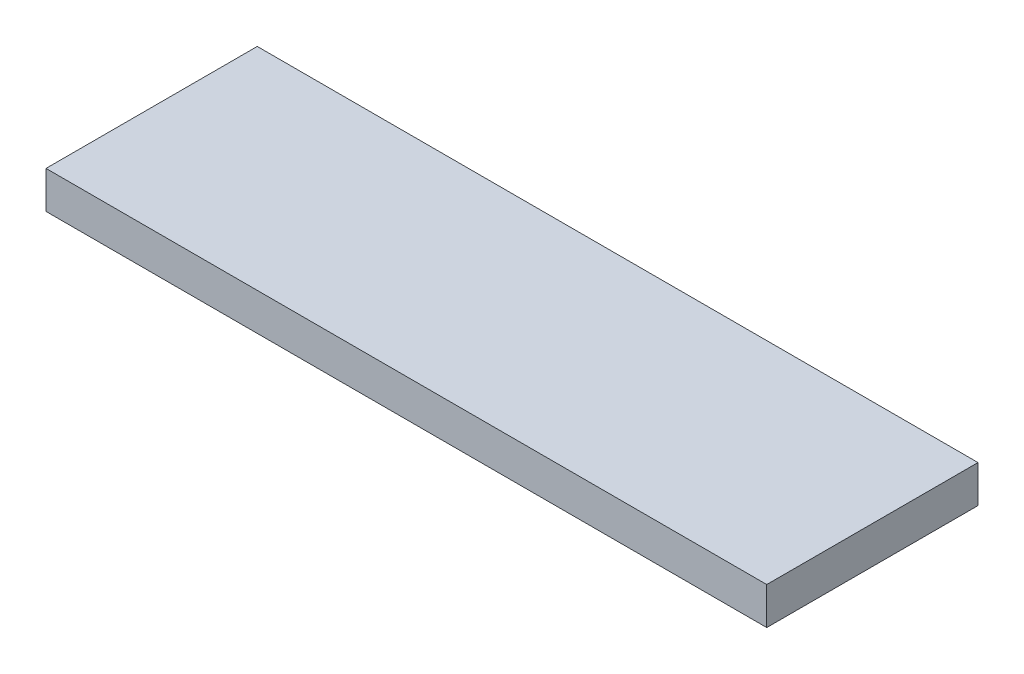
ISO-10303-21;
HEADER;
FILE_DESCRIPTION(('STEP AP214'),'2;1');
FILE_NAME('part.step','',(''),(''),'','','');
FILE_SCHEMA(('AUTOMOTIVE_DESIGN { 1 0 10303 214 1 1 1 1 }'));
ENDSEC;
DATA;
#1=APPLICATION_CONTEXT('core data for automotive mechanical design processes');
#2=APPLICATION_PROTOCOL_DEFINITION('international standard','automotive_design',2000,#1);
#3=PRODUCT_CONTEXT('',#1,'mechanical');
#4=PRODUCT('Part','Part','',(#3));
#5=PRODUCT_RELATED_PRODUCT_CATEGORY('part','',(#4));
#6=PRODUCT_DEFINITION_FORMATION('','',#4);
#7=PRODUCT_DEFINITION_CONTEXT('part definition',#1,'design');
#8=PRODUCT_DEFINITION('design','',#6,#7);
#9=PRODUCT_DEFINITION_SHAPE('','',#8);
#10=(LENGTH_UNIT() NAMED_UNIT(*) SI_UNIT(.MILLI.,.METRE.));
#11=(NAMED_UNIT(*) PLANE_ANGLE_UNIT() SI_UNIT($,.RADIAN.));
#12=(NAMED_UNIT(*) SI_UNIT($,.STERADIAN.) SOLID_ANGLE_UNIT());
#13=UNCERTAINTY_MEASURE_WITH_UNIT(LENGTH_MEASURE(1.E-05),#10,'distance_accuracy_value','');
#14=(GEOMETRIC_REPRESENTATION_CONTEXT(3) GLOBAL_UNCERTAINTY_ASSIGNED_CONTEXT((#13)) GLOBAL_UNIT_ASSIGNED_CONTEXT((#10,
#11,#12)) REPRESENTATION_CONTEXT('',''));
#15=CARTESIAN_POINT('',(0.,0.,0.));
#16=DIRECTION('',(0.,0.,1.));
#17=DIRECTION('',(1.,0.,0.));
#18=AXIS2_PLACEMENT_3D('',#15,#16,#17);
#19=CARTESIAN_POINT('',(5800.,0.,-1700.));
#20=DIRECTION('',(0.,1.,0.));
#21=DIRECTION('',(0.,0.,1.));
#22=AXIS2_PLACEMENT_3D('',#19,#20,#21);
#23=PLANE('',#22);
#24=DIRECTION('',(0.,0.,-1.));
#25=VECTOR('',#24,1.);
#26=CARTESIAN_POINT('',(4450.,0.,-250.));
#27=LINE('',#26,#25);
#28=CARTESIAN_POINT('',(4450.,0.,-250.));
#29=VERTEX_POINT('',#28);
#30=CARTESIAN_POINT('',(4450.,0.,-1450.));
#31=VERTEX_POINT('',#30);
#32=EDGE_CURVE('E208',#29,#31,#27,.T.);
#33=ORIENTED_EDGE('',*,*,#32,.F.);
#34=DIRECTION('',(-1.,0.,0.));
#35=VECTOR('',#34,1.);
#36=CARTESIAN_POINT('',(4450.,0.,-250.));
#37=LINE('',#36,#35);
#38=CARTESIAN_POINT('',(5450.,0.,-250.));
#39=VERTEX_POINT('',#38);
#40=EDGE_CURVE('E182',#39,#29,#37,.T.);
#41=ORIENTED_EDGE('',*,*,#40,.F.);
#42=DIRECTION('',(0.,0.,1.));
#43=VECTOR('',#42,1.);
#44=CARTESIAN_POINT('',(5450.,0.,-250.));
#45=LINE('',#44,#43);
#46=CARTESIAN_POINT('',(5450.,0.,-1450.));
#47=VERTEX_POINT('',#46);
#48=EDGE_CURVE('E199',#47,#39,#45,.T.);
#49=ORIENTED_EDGE('',*,*,#48,.F.);
#50=DIRECTION('',(1.,0.,0.));
#51=VECTOR('',#50,1.);
#52=CARTESIAN_POINT('',(4450.,0.,-1450.));
#53=LINE('',#52,#51);
#54=EDGE_CURVE('E202',#31,#47,#53,.T.);
#55=ORIENTED_EDGE('',*,*,#54,.F.);
#56=EDGE_LOOP('',(#33,#41,#49,#55));
#57=FACE_BOUND('',#56,.T.);
#58=DIRECTION('',(0.,0.,-1.));
#59=VECTOR('',#58,1.);
#60=CARTESIAN_POINT('',(3100.,0.,-250.));
#61=LINE('',#60,#59);
#62=CARTESIAN_POINT('',(3100.,0.,-250.));
#63=VERTEX_POINT('',#62);
#64=CARTESIAN_POINT('',(3100.,0.,-1450.));
#65=VERTEX_POINT('',#64);
#66=EDGE_CURVE('E233',#63,#65,#61,.T.);
#67=ORIENTED_EDGE('',*,*,#66,.F.);
#68=DIRECTION('',(-1.,0.,0.));
#69=VECTOR('',#68,1.);
#70=CARTESIAN_POINT('',(3100.,0.,-250.));
#71=LINE('',#70,#69);
#72=CARTESIAN_POINT('',(4100.,0.,-250.));
#73=VERTEX_POINT('',#72);
#74=EDGE_CURVE('E214',#73,#63,#71,.T.);
#75=ORIENTED_EDGE('',*,*,#74,.F.);
#76=DIRECTION('',(0.,0.,1.));
#77=VECTOR('',#76,1.);
#78=CARTESIAN_POINT('',(4100.,0.,-250.));
#79=LINE('',#78,#77);
#80=CARTESIAN_POINT('',(4100.,0.,-1450.));
#81=VERTEX_POINT('',#80);
#82=EDGE_CURVE('E222',#81,#73,#79,.T.);
#83=ORIENTED_EDGE('',*,*,#82,.F.);
#84=DIRECTION('',(1.,0.,0.));
#85=VECTOR('',#84,1.);
#86=CARTESIAN_POINT('',(3100.,0.,-1450.));
#87=LINE('',#86,#85);
#88=EDGE_CURVE('E236',#65,#81,#87,.T.);
#89=ORIENTED_EDGE('',*,*,#88,.F.);
#90=EDGE_LOOP('',(#67,#75,#83,#89));
#91=FACE_BOUND('',#90,.T.);
#92=DIRECTION('',(0.,0.,-1.));
#93=VECTOR('',#92,1.);
#94=CARTESIAN_POINT('',(1750.,0.,-250.));
#95=LINE('',#94,#93);
#96=CARTESIAN_POINT('',(1750.,0.,-250.));
#97=VERTEX_POINT('',#96);
#98=CARTESIAN_POINT('',(1750.,0.,-1450.));
#99=VERTEX_POINT('',#98);
#100=EDGE_CURVE('E265',#97,#99,#95,.T.);
#101=ORIENTED_EDGE('',*,*,#100,.F.);
#102=DIRECTION('',(-1.,0.,0.));
#103=VECTOR('',#102,1.);
#104=CARTESIAN_POINT('',(1750.,0.,-250.));
#105=LINE('',#104,#103);
#106=CARTESIAN_POINT('',(2750.,0.,-250.));
#107=VERTEX_POINT('',#106);
#108=EDGE_CURVE('E243',#107,#97,#105,.T.);
#109=ORIENTED_EDGE('',*,*,#108,.F.);
#110=DIRECTION('',(0.,0.,1.));
#111=VECTOR('',#110,1.);
#112=CARTESIAN_POINT('',(2750.,0.,-250.));
#113=LINE('',#112,#111);
#114=CARTESIAN_POINT('',(2750.,0.,-1450.));
#115=VERTEX_POINT('',#114);
#116=EDGE_CURVE('E254',#115,#107,#113,.T.);
#117=ORIENTED_EDGE('',*,*,#116,.F.);
#118=DIRECTION('',(1.,0.,0.));
#119=VECTOR('',#118,1.);
#120=CARTESIAN_POINT('',(1750.,0.,-1450.));
#121=LINE('',#120,#119);
#122=EDGE_CURVE('E268',#99,#115,#121,.T.);
#123=ORIENTED_EDGE('',*,*,#122,.F.);
#124=EDGE_LOOP('',(#101,#109,#117,#123));
#125=FACE_BOUND('',#124,.T.);
#126=DIRECTION('',(1.,0.,0.));
#127=VECTOR('',#126,1.);
#128=CARTESIAN_POINT('',(400.,0.,-1450.));
#129=LINE('',#128,#127);
#130=CARTESIAN_POINT('',(399.999999999999,0.,-1450.));
#131=VERTEX_POINT('',#130);
#132=CARTESIAN_POINT('',(1400.,0.,-1450.));
#133=VERTEX_POINT('',#132);
#134=EDGE_CURVE('E294',#131,#133,#129,.T.);
#135=ORIENTED_EDGE('',*,*,#134,.F.);
#136=DIRECTION('',(0.,0.,-1.));
#137=VECTOR('',#136,1.);
#138=CARTESIAN_POINT('',(400.,0.,-250.));
#139=LINE('',#138,#137);
#140=CARTESIAN_POINT('',(400.,0.,-250.));
#141=VERTEX_POINT('',#140);
#142=EDGE_CURVE('E275',#141,#131,#139,.T.);
#143=ORIENTED_EDGE('',*,*,#142,.F.);
#144=DIRECTION('',(-1.,0.,0.));
#145=VECTOR('',#144,1.);
#146=CARTESIAN_POINT('',(400.,0.,-250.));
#147=LINE('',#146,#145);
#148=CARTESIAN_POINT('',(1400.,0.,-250.));
#149=VERTEX_POINT('',#148);
#150=EDGE_CURVE('E285',#149,#141,#147,.T.);
#151=ORIENTED_EDGE('',*,*,#150,.F.);
#152=DIRECTION('',(0.,0.,1.));
#153=VECTOR('',#152,1.);
#154=CARTESIAN_POINT('',(1400.,0.,-250.));
#155=LINE('',#154,#153);
#156=EDGE_CURVE('E297',#133,#149,#155,.T.);
#157=ORIENTED_EDGE('',*,*,#156,.F.);
#158=EDGE_LOOP('',(#135,#143,#151,#157));
#159=FACE_BOUND('',#158,.T.);
#160=DIRECTION('',(0.,0.,-1.));
#161=VECTOR('',#160,1.);
#162=CARTESIAN_POINT('',(0.,0.,-1700.));
#163=LINE('',#162,#161);
#164=CARTESIAN_POINT('',(0.,0.,0.));
#165=VERTEX_POINT('',#164);
#166=CARTESIAN_POINT('',(0.,0.,-1700.));
#167=VERTEX_POINT('',#166);
#168=EDGE_CURVE('E304',#165,#167,#163,.T.);
#169=ORIENTED_EDGE('',*,*,#168,.T.);
#170=DIRECTION('',(-1.,0.,0.));
#171=VECTOR('',#170,1.);
#172=CARTESIAN_POINT('',(5800.,0.,-1700.));
#173=LINE('',#172,#171);
#174=CARTESIAN_POINT('',(5800.,0.,-1700.));
#175=VERTEX_POINT('',#174);
#176=EDGE_CURVE('E336',#175,#167,#173,.T.);
#177=ORIENTED_EDGE('',*,*,#176,.F.);
#178=DIRECTION('',(0.,0.,-1.));
#179=VECTOR('',#178,1.);
#180=CARTESIAN_POINT('',(5800.,0.,-1700.));
#181=LINE('',#180,#179);
#182=CARTESIAN_POINT('',(5800.,0.,0.));
#183=VERTEX_POINT('',#182);
#184=EDGE_CURVE('E310',#183,#175,#181,.T.);
#185=ORIENTED_EDGE('',*,*,#184,.F.);
#186=DIRECTION('',(-1.,0.,0.));
#187=VECTOR('',#186,1.);
#188=CARTESIAN_POINT('',(5800.,0.,0.));
#189=LINE('',#188,#187);
#190=EDGE_CURVE('E320',#183,#165,#189,.T.);
#191=ORIENTED_EDGE('',*,*,#190,.T.);
#192=EDGE_LOOP('',(#169,#177,#185,#191));
#193=FACE_BOUND('',#192,.T.);
#194=ADVANCED_FACE('F34',(#57,#91,#125,#159,#193),#23,.F.);
#195=CARTESIAN_POINT('',(5800.,300.,-1700.));
#196=DIRECTION('',(0.,0.,1.));
#197=DIRECTION('',(1.,0.,0.));
#198=AXIS2_PLACEMENT_3D('',#195,#196,#197);
#199=PLANE('',#198);
#200=DIRECTION('',(0.,1.,0.));
#201=VECTOR('',#200,1.);
#202=CARTESIAN_POINT('',(0.,300.,-1700.));
#203=LINE('',#202,#201);
#204=CARTESIAN_POINT('',(0.,300.,-1700.));
#205=VERTEX_POINT('',#204);
#206=EDGE_CURVE('E323',#167,#205,#203,.T.);
#207=ORIENTED_EDGE('',*,*,#206,.T.);
#208=DIRECTION('',(-1.,0.,0.));
#209=VECTOR('',#208,1.);
#210=CARTESIAN_POINT('',(5800.,300.,-1700.));
#211=LINE('',#210,#209);
#212=CARTESIAN_POINT('',(5800.,300.,-1700.));
#213=VERTEX_POINT('',#212);
#214=EDGE_CURVE('E333',#213,#205,#211,.T.);
#215=ORIENTED_EDGE('',*,*,#214,.F.);
#216=DIRECTION('',(0.,1.,0.));
#217=VECTOR('',#216,1.);
#218=CARTESIAN_POINT('',(5800.,300.,-1700.));
#219=LINE('',#218,#217);
#220=EDGE_CURVE('E313',#175,#213,#219,.T.);
#221=ORIENTED_EDGE('',*,*,#220,.F.);
#222=ORIENTED_EDGE('',*,*,#176,.T.);
#223=EDGE_LOOP('',(#207,#215,#221,#222));
#224=FACE_BOUND('',#223,.T.);
#225=ADVANCED_FACE('F363',(#224),#199,.F.);
#226=CARTESIAN_POINT('',(5800.,300.,0.));
#227=DIRECTION('',(0.,-1.,0.));
#228=DIRECTION('',(0.,0.,-1.));
#229=AXIS2_PLACEMENT_3D('',#226,#227,#228);
#230=PLANE('',#229);
#231=DIRECTION('',(0.,0.,1.));
#232=VECTOR('',#231,1.);
#233=CARTESIAN_POINT('',(0.,300.,0.));
#234=LINE('',#233,#232);
#235=CARTESIAN_POINT('',(0.,300.,0.));
#236=VERTEX_POINT('',#235);
#237=EDGE_CURVE('E325',#205,#236,#234,.T.);
#238=ORIENTED_EDGE('',*,*,#237,.T.);
#239=DIRECTION('',(-1.,0.,0.));
#240=VECTOR('',#239,1.);
#241=CARTESIAN_POINT('',(5800.,300.,0.));
#242=LINE('',#241,#240);
#243=CARTESIAN_POINT('',(5800.,300.,0.));
#244=VERTEX_POINT('',#243);
#245=EDGE_CURVE('E330',#244,#236,#242,.T.);
#246=ORIENTED_EDGE('',*,*,#245,.F.);
#247=DIRECTION('',(0.,0.,1.));
#248=VECTOR('',#247,1.);
#249=CARTESIAN_POINT('',(5800.,300.,0.));
#250=LINE('',#249,#248);
#251=EDGE_CURVE('E316',#213,#244,#250,.T.);
#252=ORIENTED_EDGE('',*,*,#251,.F.);
#253=ORIENTED_EDGE('',*,*,#214,.T.);
#254=EDGE_LOOP('',(#238,#246,#252,#253));
#255=FACE_BOUND('',#254,.T.);
#256=ADVANCED_FACE('F368',(#255),#230,.F.);
#257=CARTESIAN_POINT('',(5800.,0.,0.));
#258=DIRECTION('',(0.,0.,-1.));
#259=DIRECTION('',(-1.,0.,0.));
#260=AXIS2_PLACEMENT_3D('',#257,#258,#259);
#261=PLANE('',#260);
#262=DIRECTION('',(0.,-1.,0.));
#263=VECTOR('',#262,1.);
#264=CARTESIAN_POINT('',(0.,0.,0.));
#265=LINE('',#264,#263);
#266=EDGE_CURVE('E314',#236,#165,#265,.T.);
#267=ORIENTED_EDGE('',*,*,#266,.T.);
#268=ORIENTED_EDGE('',*,*,#190,.F.);
#269=DIRECTION('',(0.,-1.,0.));
#270=VECTOR('',#269,1.);
#271=CARTESIAN_POINT('',(5800.,0.,0.));
#272=LINE('',#271,#270);
#273=EDGE_CURVE('E318',#244,#183,#272,.T.);
#274=ORIENTED_EDGE('',*,*,#273,.F.);
#275=ORIENTED_EDGE('',*,*,#245,.T.);
#276=EDGE_LOOP('',(#267,#268,#274,#275));
#277=FACE_BOUND('',#276,.T.);
#278=ADVANCED_FACE('F375',(#277),#261,.F.);
#279=CARTESIAN_POINT('',(5800.,0.,0.));
#280=DIRECTION('',(-1.,0.,0.));
#281=DIRECTION('',(0.,0.,1.));
#282=AXIS2_PLACEMENT_3D('',#279,#280,#281);
#283=PLANE('',#282);
#284=ORIENTED_EDGE('',*,*,#184,.T.);
#285=ORIENTED_EDGE('',*,*,#220,.T.);
#286=ORIENTED_EDGE('',*,*,#251,.T.);
#287=ORIENTED_EDGE('',*,*,#273,.T.);
#288=EDGE_LOOP('',(#284,#285,#286,#287));
#289=FACE_BOUND('',#288,.T.);
#290=ADVANCED_FACE('F379',(#289),#283,.F.);
#291=CARTESIAN_POINT('',(0.,0.,0.));
#292=DIRECTION('',(-1.,0.,0.));
#293=DIRECTION('',(0.,0.,1.));
#294=AXIS2_PLACEMENT_3D('',#291,#292,#293);
#295=PLANE('',#294);
#296=ORIENTED_EDGE('',*,*,#168,.F.);
#297=ORIENTED_EDGE('',*,*,#266,.F.);
#298=ORIENTED_EDGE('',*,*,#237,.F.);
#299=ORIENTED_EDGE('',*,*,#206,.F.);
#300=EDGE_LOOP('',(#296,#297,#298,#299));
#301=FACE_BOUND('',#300,.T.);
#302=ADVANCED_FACE('F381',(#301),#295,.T.);
#303=CARTESIAN_POINT('',(400.,100.,-250.));
#304=DIRECTION('',(-1.,0.,0.));
#305=DIRECTION('',(0.,0.,1.));
#306=AXIS2_PLACEMENT_3D('',#303,#304,#305);
#307=PLANE('',#306);
#308=DIRECTION('',(0.,-1.,0.));
#309=VECTOR('',#308,1.);
#310=CARTESIAN_POINT('',(400.,100.,-1450.));
#311=LINE('',#310,#309);
#312=CARTESIAN_POINT('',(400.,60.,-1450.));
#313=VERTEX_POINT('',#312);
#314=EDGE_CURVE('E291',#313,#131,#311,.T.);
#315=ORIENTED_EDGE('',*,*,#314,.F.);
#316=DIRECTION('',(0.,0.,-1.));
#317=VECTOR('',#316,1.);
#318=CARTESIAN_POINT('',(400.,60.,-250.));
#319=LINE('',#318,#317);
#320=CARTESIAN_POINT('',(400.,60.,-250.));
#321=VERTEX_POINT('',#320);
#322=EDGE_CURVE('E42',#313,#321,#319,.F.);
#323=ORIENTED_EDGE('',*,*,#322,.T.);
#324=DIRECTION('',(0.,-1.,0.));
#325=VECTOR('',#324,1.);
#326=CARTESIAN_POINT('',(400.,100.,-250.));
#327=LINE('',#326,#325);
#328=EDGE_CURVE('E302',#321,#141,#327,.T.);
#329=ORIENTED_EDGE('',*,*,#328,.T.);
#330=ORIENTED_EDGE('',*,*,#142,.T.);
#331=EDGE_LOOP('',(#315,#323,#329,#330));
#332=FACE_BOUND('',#331,.T.);
#333=ADVANCED_FACE('F384',(#332),#307,.F.);
#334=CARTESIAN_POINT('',(400.,100.,-250.));
#335=DIRECTION('',(0.,0.,1.));
#336=DIRECTION('',(0.,-1.,0.));
#337=AXIS2_PLACEMENT_3D('',#334,#335,#336);
#338=PLANE('',#337);
#339=ORIENTED_EDGE('',*,*,#328,.F.);
#340=CARTESIAN_POINT('',(440.,60.,-250.));
#341=DIRECTION('',(0.,0.,1.));
#342=DIRECTION('',(0.,-1.,0.));
#343=AXIS2_PLACEMENT_3D('',#340,#341,#342);
#344=CIRCLE('',#343,40.);
#345=CARTESIAN_POINT('',(440.,100.,-250.));
#346=VERTEX_POINT('',#345);
#347=EDGE_CURVE('E11',#321,#346,#344,.F.);
#348=ORIENTED_EDGE('',*,*,#347,.T.);
#349=DIRECTION('',(-1.,0.,0.));
#350=VECTOR('',#349,1.);
#351=CARTESIAN_POINT('',(400.,100.,-250.));
#352=LINE('',#351,#350);
#353=CARTESIAN_POINT('',(1400.,100.,-250.));
#354=VERTEX_POINT('',#353);
#355=EDGE_CURVE('E288',#354,#346,#352,.T.);
#356=ORIENTED_EDGE('',*,*,#355,.F.);
#357=DIRECTION('',(0.,-1.,0.));
#358=VECTOR('',#357,1.);
#359=CARTESIAN_POINT('',(1400.,100.,-250.));
#360=LINE('',#359,#358);
#361=EDGE_CURVE('E305',#354,#149,#360,.T.);
#362=ORIENTED_EDGE('',*,*,#361,.T.);
#363=ORIENTED_EDGE('',*,*,#150,.T.);
#364=EDGE_LOOP('',(#339,#348,#356,#362,#363));
#365=FACE_BOUND('',#364,.T.);
#366=ADVANCED_FACE('F356',(#365),#338,.F.);
#367=CARTESIAN_POINT('',(1400.,100.,-250.));
#368=DIRECTION('',(1.,0.,0.));
#369=DIRECTION('',(0.,0.,-1.));
#370=AXIS2_PLACEMENT_3D('',#367,#368,#369);
#371=PLANE('',#370);
#372=ORIENTED_EDGE('',*,*,#156,.T.);
#373=ORIENTED_EDGE('',*,*,#361,.F.);
#374=DIRECTION('',(0.,0.,1.));
#375=VECTOR('',#374,1.);
#376=CARTESIAN_POINT('',(1400.,100.,-250.));
#377=LINE('',#376,#375);
#378=CARTESIAN_POINT('',(1400.,100.,-1450.));
#379=VERTEX_POINT('',#378);
#380=EDGE_CURVE('E284',#379,#354,#377,.T.);
#381=ORIENTED_EDGE('',*,*,#380,.F.);
#382=DIRECTION('',(0.,-1.,0.));
#383=VECTOR('',#382,1.);
#384=CARTESIAN_POINT('',(1400.,100.,-1450.));
#385=LINE('',#384,#383);
#386=EDGE_CURVE('E307',#379,#133,#385,.T.);
#387=ORIENTED_EDGE('',*,*,#386,.T.);
#388=EDGE_LOOP('',(#372,#373,#381,#387));
#389=FACE_BOUND('',#388,.T.);
#390=ADVANCED_FACE('F354',(#389),#371,.F.);
#391=CARTESIAN_POINT('',(400.,100.,-1450.));
#392=DIRECTION('',(0.,0.,-1.));
#393=DIRECTION('',(0.,1.,0.));
#394=AXIS2_PLACEMENT_3D('',#391,#392,#393);
#395=PLANE('',#394);
#396=DIRECTION('',(1.,0.,0.));
#397=VECTOR('',#396,1.);
#398=CARTESIAN_POINT('',(400.,100.,-1450.));
#399=LINE('',#398,#397);
#400=CARTESIAN_POINT('',(440.,100.,-1450.));
#401=VERTEX_POINT('',#400);
#402=EDGE_CURVE('E282',#401,#379,#399,.T.);
#403=ORIENTED_EDGE('',*,*,#402,.F.);
#404=CARTESIAN_POINT('',(440.,60.,-1450.));
#405=DIRECTION('',(0.,0.,-1.));
#406=DIRECTION('',(0.,1.,0.));
#407=AXIS2_PLACEMENT_3D('',#404,#405,#406);
#408=CIRCLE('',#407,40.);
#409=EDGE_CURVE('E56',#401,#313,#408,.F.);
#410=ORIENTED_EDGE('',*,*,#409,.T.);
#411=ORIENTED_EDGE('',*,*,#314,.T.);
#412=ORIENTED_EDGE('',*,*,#134,.T.);
#413=ORIENTED_EDGE('',*,*,#386,.F.);
#414=EDGE_LOOP('',(#403,#410,#411,#412,#413));
#415=FACE_BOUND('',#414,.T.);
#416=ADVANCED_FACE('F349',(#415),#395,.F.);
#417=CARTESIAN_POINT('',(0.,100.,0.));
#418=DIRECTION('',(0.,-1.,0.));
#419=DIRECTION('',(0.,0.,-1.));
#420=AXIS2_PLACEMENT_3D('',#417,#418,#419);
#421=PLANE('',#420);
#422=ORIENTED_EDGE('',*,*,#355,.T.);
#423=DIRECTION('',(0.,0.,-1.));
#424=VECTOR('',#423,1.);
#425=CARTESIAN_POINT('',(440.,100.,0.));
#426=LINE('',#425,#424);
#427=EDGE_CURVE('E339',#346,#401,#426,.T.);
#428=ORIENTED_EDGE('',*,*,#427,.T.);
#429=ORIENTED_EDGE('',*,*,#402,.T.);
#430=ORIENTED_EDGE('',*,*,#380,.T.);
#431=EDGE_LOOP('',(#422,#428,#429,#430));
#432=FACE_BOUND('',#431,.T.);
#433=ADVANCED_FACE('F344',(#432),#421,.T.);
#434=CARTESIAN_POINT('',(1750.,100.,-250.));
#435=DIRECTION('',(0.,0.,1.));
#436=DIRECTION('',(0.,-1.,0.));
#437=AXIS2_PLACEMENT_3D('',#434,#435,#436);
#438=PLANE('',#437);
#439=ORIENTED_EDGE('',*,*,#108,.T.);
#440=DIRECTION('',(0.,-1.,0.));
#441=VECTOR('',#440,1.);
#442=CARTESIAN_POINT('',(1750.,100.,-250.));
#443=LINE('',#442,#441);
#444=CARTESIAN_POINT('',(1750.,100.,-250.));
#445=VERTEX_POINT('',#444);
#446=EDGE_CURVE('E263',#445,#97,#443,.T.);
#447=ORIENTED_EDGE('',*,*,#446,.F.);
#448=DIRECTION('',(-1.,0.,0.));
#449=VECTOR('',#448,1.);
#450=CARTESIAN_POINT('',(1750.,100.,-250.));
#451=LINE('',#450,#449);
#452=CARTESIAN_POINT('',(2750.,100.,-250.));
#453=VERTEX_POINT('',#452);
#454=EDGE_CURVE('E250',#453,#445,#451,.T.);
#455=ORIENTED_EDGE('',*,*,#454,.F.);
#456=DIRECTION('',(0.,-1.,0.));
#457=VECTOR('',#456,1.);
#458=CARTESIAN_POINT('',(2750.,100.,-250.));
#459=LINE('',#458,#457);
#460=EDGE_CURVE('E273',#453,#107,#459,.T.);
#461=ORIENTED_EDGE('',*,*,#460,.T.);
#462=EDGE_LOOP('',(#439,#447,#455,#461));
#463=FACE_BOUND('',#462,.T.);
#464=ADVANCED_FACE('F399',(#463),#438,.F.);
#465=CARTESIAN_POINT('',(2750.,100.,-250.));
#466=DIRECTION('',(1.,0.,0.));
#467=DIRECTION('',(0.,0.,-1.));
#468=AXIS2_PLACEMENT_3D('',#465,#466,#467);
#469=PLANE('',#468);
#470=ORIENTED_EDGE('',*,*,#116,.T.);
#471=ORIENTED_EDGE('',*,*,#460,.F.);
#472=DIRECTION('',(0.,0.,1.));
#473=VECTOR('',#472,1.);
#474=CARTESIAN_POINT('',(2750.,100.,-250.));
#475=LINE('',#474,#473);
#476=CARTESIAN_POINT('',(2750.,100.,-1450.));
#477=VERTEX_POINT('',#476);
#478=EDGE_CURVE('E260',#477,#453,#475,.T.);
#479=ORIENTED_EDGE('',*,*,#478,.F.);
#480=DIRECTION('',(0.,-1.,0.));
#481=VECTOR('',#480,1.);
#482=CARTESIAN_POINT('',(2750.,100.,-1450.));
#483=LINE('',#482,#481);
#484=EDGE_CURVE('E276',#477,#115,#483,.T.);
#485=ORIENTED_EDGE('',*,*,#484,.T.);
#486=EDGE_LOOP('',(#470,#471,#479,#485));
#487=FACE_BOUND('',#486,.T.);
#488=ADVANCED_FACE('F402',(#487),#469,.F.);
#489=CARTESIAN_POINT('',(1750.,100.,-1450.));
#490=DIRECTION('',(0.,0.,-1.));
#491=DIRECTION('',(0.,1.,0.));
#492=AXIS2_PLACEMENT_3D('',#489,#490,#491);
#493=PLANE('',#492);
#494=ORIENTED_EDGE('',*,*,#122,.T.);
#495=ORIENTED_EDGE('',*,*,#484,.F.);
#496=DIRECTION('',(1.,0.,0.));
#497=VECTOR('',#496,1.);
#498=CARTESIAN_POINT('',(1750.,100.,-1450.));
#499=LINE('',#498,#497);
#500=CARTESIAN_POINT('',(1750.,100.,-1450.));
#501=VERTEX_POINT('',#500);
#502=EDGE_CURVE('E257',#501,#477,#499,.T.);
#503=ORIENTED_EDGE('',*,*,#502,.F.);
#504=DIRECTION('',(0.,-1.,0.));
#505=VECTOR('',#504,1.);
#506=CARTESIAN_POINT('',(1750.,100.,-1450.));
#507=LINE('',#506,#505);
#508=EDGE_CURVE('E278',#501,#99,#507,.T.);
#509=ORIENTED_EDGE('',*,*,#508,.T.);
#510=EDGE_LOOP('',(#494,#495,#503,#509));
#511=FACE_BOUND('',#510,.T.);
#512=ADVANCED_FACE('F408',(#511),#493,.F.);
#513=CARTESIAN_POINT('',(1750.,100.,-250.));
#514=DIRECTION('',(-1.,0.,0.));
#515=DIRECTION('',(0.,0.,1.));
#516=AXIS2_PLACEMENT_3D('',#513,#514,#515);
#517=PLANE('',#516);
#518=ORIENTED_EDGE('',*,*,#100,.T.);
#519=ORIENTED_EDGE('',*,*,#508,.F.);
#520=DIRECTION('',(0.,0.,-1.));
#521=VECTOR('',#520,1.);
#522=CARTESIAN_POINT('',(1750.,100.,-250.));
#523=LINE('',#522,#521);
#524=EDGE_CURVE('E253',#445,#501,#523,.T.);
#525=ORIENTED_EDGE('',*,*,#524,.F.);
#526=ORIENTED_EDGE('',*,*,#446,.T.);
#527=EDGE_LOOP('',(#518,#519,#525,#526));
#528=FACE_BOUND('',#527,.T.);
#529=ADVANCED_FACE('F404',(#528),#517,.F.);
#530=CARTESIAN_POINT('',(0.,100.,0.));
#531=DIRECTION('',(0.,1.,0.));
#532=DIRECTION('',(0.,0.,1.));
#533=AXIS2_PLACEMENT_3D('',#530,#531,#532);
#534=PLANE('',#533);
#535=ORIENTED_EDGE('',*,*,#454,.T.);
#536=ORIENTED_EDGE('',*,*,#524,.T.);
#537=ORIENTED_EDGE('',*,*,#502,.T.);
#538=ORIENTED_EDGE('',*,*,#478,.T.);
#539=EDGE_LOOP('',(#535,#536,#537,#538));
#540=FACE_BOUND('',#539,.T.);
#541=ADVANCED_FACE('F407',(#540),#534,.F.);
#542=CARTESIAN_POINT('',(3100.,100.,-250.));
#543=DIRECTION('',(0.,0.,1.));
#544=DIRECTION('',(0.,-1.,0.));
#545=AXIS2_PLACEMENT_3D('',#542,#543,#544);
#546=PLANE('',#545);
#547=ORIENTED_EDGE('',*,*,#74,.T.);
#548=DIRECTION('',(0.,-1.,0.));
#549=VECTOR('',#548,1.);
#550=CARTESIAN_POINT('',(3100.,100.,-250.));
#551=LINE('',#550,#549);
#552=CARTESIAN_POINT('',(3100.,100.,-250.));
#553=VERTEX_POINT('',#552);
#554=EDGE_CURVE('E231',#553,#63,#551,.T.);
#555=ORIENTED_EDGE('',*,*,#554,.F.);
#556=DIRECTION('',(-1.,0.,0.));
#557=VECTOR('',#556,1.);
#558=CARTESIAN_POINT('',(3100.,100.,-250.));
#559=LINE('',#558,#557);
#560=CARTESIAN_POINT('',(4100.,100.,-250.));
#561=VERTEX_POINT('',#560);
#562=EDGE_CURVE('E218',#561,#553,#559,.T.);
#563=ORIENTED_EDGE('',*,*,#562,.F.);
#564=DIRECTION('',(0.,-1.,0.));
#565=VECTOR('',#564,1.);
#566=CARTESIAN_POINT('',(4100.,100.,-250.));
#567=LINE('',#566,#565);
#568=EDGE_CURVE('E241',#561,#73,#567,.T.);
#569=ORIENTED_EDGE('',*,*,#568,.T.);
#570=EDGE_LOOP('',(#547,#555,#563,#569));
#571=FACE_BOUND('',#570,.T.);
#572=ADVANCED_FACE('F418',(#571),#546,.F.);
#573=CARTESIAN_POINT('',(4100.,100.,-250.));
#574=DIRECTION('',(1.,0.,0.));
#575=DIRECTION('',(0.,0.,-1.));
#576=AXIS2_PLACEMENT_3D('',#573,#574,#575);
#577=PLANE('',#576);
#578=ORIENTED_EDGE('',*,*,#82,.T.);
#579=ORIENTED_EDGE('',*,*,#568,.F.);
#580=DIRECTION('',(0.,0.,1.));
#581=VECTOR('',#580,1.);
#582=CARTESIAN_POINT('',(4100.,100.,-250.));
#583=LINE('',#582,#581);
#584=CARTESIAN_POINT('',(4100.,100.,-1450.));
#585=VERTEX_POINT('',#584);
#586=EDGE_CURVE('E228',#585,#561,#583,.T.);
#587=ORIENTED_EDGE('',*,*,#586,.F.);
#588=DIRECTION('',(0.,-1.,0.));
#589=VECTOR('',#588,1.);
#590=CARTESIAN_POINT('',(4100.,100.,-1450.));
#591=LINE('',#590,#589);
#592=EDGE_CURVE('E244',#585,#81,#591,.T.);
#593=ORIENTED_EDGE('',*,*,#592,.T.);
#594=EDGE_LOOP('',(#578,#579,#587,#593));
#595=FACE_BOUND('',#594,.T.);
#596=ADVANCED_FACE('F422',(#595),#577,.F.);
#597=CARTESIAN_POINT('',(3100.,100.,-1450.));
#598=DIRECTION('',(0.,0.,-1.));
#599=DIRECTION('',(0.,1.,0.));
#600=AXIS2_PLACEMENT_3D('',#597,#598,#599);
#601=PLANE('',#600);
#602=ORIENTED_EDGE('',*,*,#88,.T.);
#603=ORIENTED_EDGE('',*,*,#592,.F.);
#604=DIRECTION('',(1.,0.,0.));
#605=VECTOR('',#604,1.);
#606=CARTESIAN_POINT('',(3100.,100.,-1450.));
#607=LINE('',#606,#605);
#608=CARTESIAN_POINT('',(3100.,100.,-1450.));
#609=VERTEX_POINT('',#608);
#610=EDGE_CURVE('E225',#609,#585,#607,.T.);
#611=ORIENTED_EDGE('',*,*,#610,.F.);
#612=DIRECTION('',(0.,-1.,0.));
#613=VECTOR('',#612,1.);
#614=CARTESIAN_POINT('',(3100.,100.,-1450.));
#615=LINE('',#614,#613);
#616=EDGE_CURVE('E246',#609,#65,#615,.T.);
#617=ORIENTED_EDGE('',*,*,#616,.T.);
#618=EDGE_LOOP('',(#602,#603,#611,#617));
#619=FACE_BOUND('',#618,.T.);
#620=ADVANCED_FACE('F428',(#619),#601,.F.);
#621=CARTESIAN_POINT('',(3100.,100.,-250.));
#622=DIRECTION('',(-1.,0.,0.));
#623=DIRECTION('',(0.,0.,1.));
#624=AXIS2_PLACEMENT_3D('',#621,#622,#623);
#625=PLANE('',#624);
#626=ORIENTED_EDGE('',*,*,#66,.T.);
#627=ORIENTED_EDGE('',*,*,#616,.F.);
#628=DIRECTION('',(0.,0.,-1.));
#629=VECTOR('',#628,1.);
#630=CARTESIAN_POINT('',(3100.,100.,-250.));
#631=LINE('',#630,#629);
#632=EDGE_CURVE('E221',#553,#609,#631,.T.);
#633=ORIENTED_EDGE('',*,*,#632,.F.);
#634=ORIENTED_EDGE('',*,*,#554,.T.);
#635=EDGE_LOOP('',(#626,#627,#633,#634));
#636=FACE_BOUND('',#635,.T.);
#637=ADVANCED_FACE('F424',(#636),#625,.F.);
#638=CARTESIAN_POINT('',(0.,100.,0.));
#639=DIRECTION('',(0.,1.,0.));
#640=DIRECTION('',(0.,0.,1.));
#641=AXIS2_PLACEMENT_3D('',#638,#639,#640);
#642=PLANE('',#641);
#643=ORIENTED_EDGE('',*,*,#562,.T.);
#644=ORIENTED_EDGE('',*,*,#632,.T.);
#645=ORIENTED_EDGE('',*,*,#610,.T.);
#646=ORIENTED_EDGE('',*,*,#586,.T.);
#647=EDGE_LOOP('',(#643,#644,#645,#646));
#648=FACE_BOUND('',#647,.T.);
#649=ADVANCED_FACE('F427',(#648),#642,.F.);
#650=CARTESIAN_POINT('',(4450.,100.,-250.));
#651=DIRECTION('',(0.,0.,1.));
#652=DIRECTION('',(0.,-1.,0.));
#653=AXIS2_PLACEMENT_3D('',#650,#651,#652);
#654=PLANE('',#653);
#655=ORIENTED_EDGE('',*,*,#40,.T.);
#656=DIRECTION('',(0.,-1.,0.));
#657=VECTOR('',#656,1.);
#658=CARTESIAN_POINT('',(4450.,100.,-250.));
#659=LINE('',#658,#657);
#660=CARTESIAN_POINT('',(4450.,100.,-250.));
#661=VERTEX_POINT('',#660);
#662=EDGE_CURVE('E175',#661,#29,#659,.T.);
#663=ORIENTED_EDGE('',*,*,#662,.F.);
#664=DIRECTION('',(-1.,0.,0.));
#665=VECTOR('',#664,1.);
#666=CARTESIAN_POINT('',(4450.,100.,-250.));
#667=LINE('',#666,#665);
#668=CARTESIAN_POINT('',(5450.,100.,-250.));
#669=VERTEX_POINT('',#668);
#670=EDGE_CURVE('E179',#669,#661,#667,.T.);
#671=ORIENTED_EDGE('',*,*,#670,.F.);
#672=DIRECTION('',(0.,-1.,0.));
#673=VECTOR('',#672,1.);
#674=CARTESIAN_POINT('',(5450.,100.,-250.));
#675=LINE('',#674,#673);
#676=EDGE_CURVE('E212',#669,#39,#675,.T.);
#677=ORIENTED_EDGE('',*,*,#676,.T.);
#678=EDGE_LOOP('',(#655,#663,#671,#677));
#679=FACE_BOUND('',#678,.T.);
#680=ADVANCED_FACE('F177',(#679),#654,.F.);
#681=CARTESIAN_POINT('',(5450.,100.,-250.));
#682=DIRECTION('',(1.,0.,0.));
#683=DIRECTION('',(0.,0.,-1.));
#684=AXIS2_PLACEMENT_3D('',#681,#682,#683);
#685=PLANE('',#684);
#686=ORIENTED_EDGE('',*,*,#48,.T.);
#687=ORIENTED_EDGE('',*,*,#676,.F.);
#688=DIRECTION('',(0.,0.,1.));
#689=VECTOR('',#688,1.);
#690=CARTESIAN_POINT('',(5450.,100.,-250.));
#691=LINE('',#690,#689);
#692=CARTESIAN_POINT('',(5450.,100.,-1450.));
#693=VERTEX_POINT('',#692);
#694=EDGE_CURVE('E187',#693,#669,#691,.T.);
#695=ORIENTED_EDGE('',*,*,#694,.F.);
#696=DIRECTION('',(0.,-1.,0.));
#697=VECTOR('',#696,1.);
#698=CARTESIAN_POINT('',(5450.,100.,-1450.));
#699=LINE('',#698,#697);
#700=EDGE_CURVE('E215',#693,#47,#699,.T.);
#701=ORIENTED_EDGE('',*,*,#700,.T.);
#702=EDGE_LOOP('',(#686,#687,#695,#701));
#703=FACE_BOUND('',#702,.T.);
#704=ADVANCED_FACE('F441',(#703),#685,.F.);
#705=CARTESIAN_POINT('',(4450.,100.,-1450.));
#706=DIRECTION('',(0.,0.,-1.));
#707=DIRECTION('',(0.,1.,0.));
#708=AXIS2_PLACEMENT_3D('',#705,#706,#707);
#709=PLANE('',#708);
#710=ORIENTED_EDGE('',*,*,#54,.T.);
#711=ORIENTED_EDGE('',*,*,#700,.F.);
#712=DIRECTION('',(1.,0.,0.));
#713=VECTOR('',#712,1.);
#714=CARTESIAN_POINT('',(4450.,100.,-1450.));
#715=LINE('',#714,#713);
#716=CARTESIAN_POINT('',(4450.,100.,-1450.));
#717=VERTEX_POINT('',#716);
#718=EDGE_CURVE('E195',#717,#693,#715,.T.);
#719=ORIENTED_EDGE('',*,*,#718,.F.);
#720=DIRECTION('',(0.,-1.,0.));
#721=VECTOR('',#720,1.);
#722=CARTESIAN_POINT('',(4450.,100.,-1450.));
#723=LINE('',#722,#721);
#724=EDGE_CURVE('E186',#717,#31,#723,.T.);
#725=ORIENTED_EDGE('',*,*,#724,.T.);
#726=EDGE_LOOP('',(#710,#711,#719,#725));
#727=FACE_BOUND('',#726,.T.);
#728=ADVANCED_FACE('F444',(#727),#709,.F.);
#729=CARTESIAN_POINT('',(4450.,100.,-250.));
#730=DIRECTION('',(-1.,0.,0.));
#731=DIRECTION('',(0.,0.,1.));
#732=AXIS2_PLACEMENT_3D('',#729,#730,#731);
#733=PLANE('',#732);
#734=ORIENTED_EDGE('',*,*,#32,.T.);
#735=ORIENTED_EDGE('',*,*,#724,.F.);
#736=DIRECTION('',(0.,0.,-1.));
#737=VECTOR('',#736,1.);
#738=CARTESIAN_POINT('',(4450.,100.,-250.));
#739=LINE('',#738,#737);
#740=EDGE_CURVE('E190',#661,#717,#739,.T.);
#741=ORIENTED_EDGE('',*,*,#740,.F.);
#742=ORIENTED_EDGE('',*,*,#662,.T.);
#743=EDGE_LOOP('',(#734,#735,#741,#742));
#744=FACE_BOUND('',#743,.T.);
#745=ADVANCED_FACE('F191',(#744),#733,.F.);
#746=CARTESIAN_POINT('',(0.,100.,0.));
#747=DIRECTION('',(0.,1.,0.));
#748=DIRECTION('',(0.,0.,1.));
#749=AXIS2_PLACEMENT_3D('',#746,#747,#748);
#750=PLANE('',#749);
#751=ORIENTED_EDGE('',*,*,#670,.T.);
#752=ORIENTED_EDGE('',*,*,#740,.T.);
#753=ORIENTED_EDGE('',*,*,#718,.T.);
#754=ORIENTED_EDGE('',*,*,#694,.T.);
#755=EDGE_LOOP('',(#751,#752,#753,#754));
#756=FACE_BOUND('',#755,.T.);
#757=ADVANCED_FACE('F197',(#756),#750,.F.);
#758=CARTESIAN_POINT('',(440.,60.,0.));
#759=DIRECTION('',(0.,0.,-1.));
#760=DIRECTION('',(-1.,0.,0.));
#761=AXIS2_PLACEMENT_3D('',#758,#759,#760);
#762=CYLINDRICAL_SURFACE('',#761,40.);
#763=ORIENTED_EDGE('',*,*,#347,.F.);
#764=ORIENTED_EDGE('',*,*,#322,.F.);
#765=ORIENTED_EDGE('',*,*,#409,.F.);
#766=ORIENTED_EDGE('',*,*,#427,.F.);
#767=EDGE_LOOP('',(#763,#764,#765,#766));
#768=FACE_BOUND('',#767,.T.);
#769=ADVANCED_FACE('F36',(#768),#762,.F.);
#770=CLOSED_SHELL('',(#194,#225,#256,#278,#290,#302,#333,#366,#390,#416,#433,#464,#488,#512,
#529,#541,#572,#596,#620,#637,#649,#680,#704,#728,#745,#757,#769));
#771=MANIFOLD_SOLID_BREP('B2',#770);
#772=ADVANCED_BREP_SHAPE_REPRESENTATION('',(#18,#771),#14);
#773=SHAPE_DEFINITION_REPRESENTATION(#9,#772);
ENDSEC;
END-ISO-10303-21;
